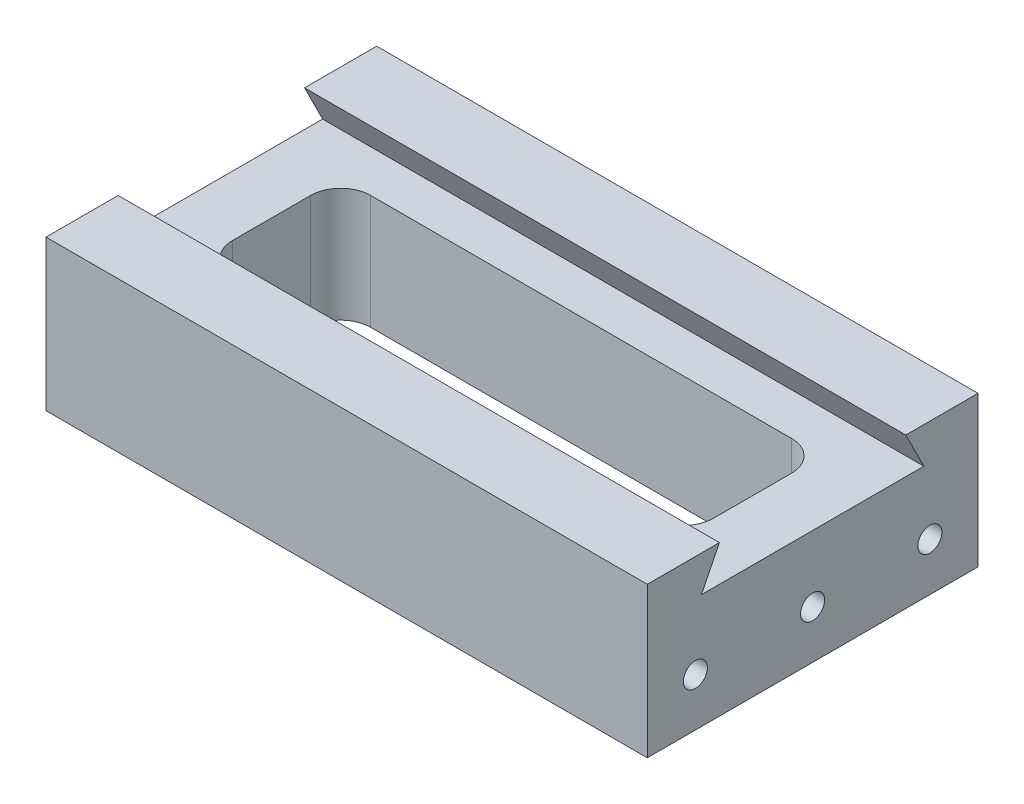
ISO-10303-21;
HEADER;
FILE_DESCRIPTION(('STEP AP214'),'2;1');
FILE_NAME('part.step','',(''),(''),'','','');
FILE_SCHEMA(('AUTOMOTIVE_DESIGN { 1 0 10303 214 1 1 1 1 }'));
ENDSEC;
DATA;
#1=APPLICATION_CONTEXT('core data for automotive mechanical design processes');
#2=APPLICATION_PROTOCOL_DEFINITION('international standard','automotive_design',2000,#1);
#3=PRODUCT_CONTEXT('',#1,'mechanical');
#4=PRODUCT('Part','Part','',(#3));
#5=PRODUCT_RELATED_PRODUCT_CATEGORY('part','',(#4));
#6=PRODUCT_DEFINITION_FORMATION('','',#4);
#7=PRODUCT_DEFINITION_CONTEXT('part definition',#1,'design');
#8=PRODUCT_DEFINITION('design','',#6,#7);
#9=PRODUCT_DEFINITION_SHAPE('','',#8);
#10=(LENGTH_UNIT() NAMED_UNIT(*) SI_UNIT(.MILLI.,.METRE.));
#11=(NAMED_UNIT(*) PLANE_ANGLE_UNIT() SI_UNIT($,.RADIAN.));
#12=(NAMED_UNIT(*) SI_UNIT($,.STERADIAN.) SOLID_ANGLE_UNIT());
#13=UNCERTAINTY_MEASURE_WITH_UNIT(LENGTH_MEASURE(1.E-05),#10,'distance_accuracy_value','');
#14=(GEOMETRIC_REPRESENTATION_CONTEXT(3) GLOBAL_UNCERTAINTY_ASSIGNED_CONTEXT((#13)) GLOBAL_UNIT_ASSIGNED_CONTEXT((#10,
#11,#12)) REPRESENTATION_CONTEXT('',''));
#15=CARTESIAN_POINT('',(0.,0.,0.));
#16=DIRECTION('',(0.,0.,1.));
#17=DIRECTION('',(1.,0.,0.));
#18=AXIS2_PLACEMENT_3D('',#15,#16,#17);
#19=CARTESIAN_POINT('',(50.,0.,0.));
#20=DIRECTION('',(0.,1.,0.));
#21=DIRECTION('',(0.,0.,1.));
#22=AXIS2_PLACEMENT_3D('',#19,#20,#21);
#23=PLANE('',#22);
#24=DIRECTION('',(0.,0.,-1.));
#25=VECTOR('',#24,1.);
#26=CARTESIAN_POINT('',(-50.,0.,0.));
#27=LINE('',#26,#25);
#28=CARTESIAN_POINT('',(-50.,0.,0.));
#29=VERTEX_POINT('',#28);
#30=CARTESIAN_POINT('',(-50.,0.,-55.));
#31=VERTEX_POINT('',#30);
#32=EDGE_CURVE('E289',#29,#31,#27,.T.);
#33=ORIENTED_EDGE('',*,*,#32,.T.);
#34=DIRECTION('',(-1.,0.,0.));
#35=VECTOR('',#34,1.);
#36=CARTESIAN_POINT('',(50.,0.,-55.));
#37=LINE('',#36,#35);
#38=CARTESIAN_POINT('',(50.,0.,-55.));
#39=VERTEX_POINT('',#38);
#40=EDGE_CURVE('E42',#39,#31,#37,.T.);
#41=ORIENTED_EDGE('',*,*,#40,.F.);
#42=DIRECTION('',(0.,0.,-1.));
#43=VECTOR('',#42,1.);
#44=CARTESIAN_POINT('',(50.,0.,0.));
#45=LINE('',#44,#43);
#46=CARTESIAN_POINT('',(50.,0.,0.));
#47=VERTEX_POINT('',#46);
#48=EDGE_CURVE('E271',#47,#39,#45,.T.);
#49=ORIENTED_EDGE('',*,*,#48,.F.);
#50=DIRECTION('',(-1.,0.,0.));
#51=VECTOR('',#50,1.);
#52=CARTESIAN_POINT('',(50.,0.,0.));
#53=LINE('',#52,#51);
#54=EDGE_CURVE('E11',#47,#29,#53,.T.);
#55=ORIENTED_EDGE('',*,*,#54,.T.);
#56=EDGE_LOOP('',(#33,#41,#49,#55));
#57=FACE_BOUND('',#56,.T.);
#58=DIRECTION('',(1.,0.,0.));
#59=VECTOR('',#58,1.);
#60=CARTESIAN_POINT('',(0.,0.,-39.));
#61=LINE('',#60,#59);
#62=CARTESIAN_POINT('',(-35.,0.,-39.));
#63=VERTEX_POINT('',#62);
#64=CARTESIAN_POINT('',(35.,0.,-39.));
#65=VERTEX_POINT('',#64);
#66=EDGE_CURVE('E167',#63,#65,#61,.T.);
#67=ORIENTED_EDGE('',*,*,#66,.F.);
#68=CARTESIAN_POINT('',(-35.,0.,-34.));
#69=DIRECTION('',(0.,1.,0.));
#70=DIRECTION('',(0.,0.,1.));
#71=AXIS2_PLACEMENT_3D('',#68,#69,#70);
#72=CIRCLE('',#71,5.);
#73=CARTESIAN_POINT('',(-40.,0.,-34.));
#74=VERTEX_POINT('',#73);
#75=EDGE_CURVE('E176',#63,#74,#72,.T.);
#76=ORIENTED_EDGE('',*,*,#75,.T.);
#77=DIRECTION('',(0.,0.,1.));
#78=VECTOR('',#77,1.);
#79=CARTESIAN_POINT('',(-40.,0.,0.));
#80=LINE('',#79,#78);
#81=CARTESIAN_POINT('',(-40.,0.,-21.));
#82=VERTEX_POINT('',#81);
#83=EDGE_CURVE('E49',#74,#82,#80,.T.);
#84=ORIENTED_EDGE('',*,*,#83,.T.);
#85=CARTESIAN_POINT('',(-35.,0.,-21.));
#86=DIRECTION('',(0.,1.,0.));
#87=DIRECTION('',(0.,0.,1.));
#88=AXIS2_PLACEMENT_3D('',#85,#86,#87);
#89=CIRCLE('',#88,5.);
#90=CARTESIAN_POINT('',(-35.,0.,-16.));
#91=VERTEX_POINT('',#90);
#92=EDGE_CURVE('E189',#82,#91,#89,.T.);
#93=ORIENTED_EDGE('',*,*,#92,.T.);
#94=DIRECTION('',(1.,0.,0.));
#95=VECTOR('',#94,1.);
#96=CARTESIAN_POINT('',(0.,0.,-16.));
#97=LINE('',#96,#95);
#98=CARTESIAN_POINT('',(35.,0.,-16.));
#99=VERTEX_POINT('',#98);
#100=EDGE_CURVE('E192',#91,#99,#97,.T.);
#101=ORIENTED_EDGE('',*,*,#100,.T.);
#102=CARTESIAN_POINT('',(35.,0.,-21.));
#103=DIRECTION('',(0.,1.,0.));
#104=DIRECTION('',(0.,0.,1.));
#105=AXIS2_PLACEMENT_3D('',#102,#103,#104);
#106=CIRCLE('',#105,5.);
#107=CARTESIAN_POINT('',(40.,0.,-21.));
#108=VERTEX_POINT('',#107);
#109=EDGE_CURVE('E195',#99,#108,#106,.T.);
#110=ORIENTED_EDGE('',*,*,#109,.T.);
#111=DIRECTION('',(0.,0.,1.));
#112=VECTOR('',#111,1.);
#113=CARTESIAN_POINT('',(40.,0.,0.));
#114=LINE('',#113,#112);
#115=CARTESIAN_POINT('',(40.,0.,-34.));
#116=VERTEX_POINT('',#115);
#117=EDGE_CURVE('E198',#116,#108,#114,.T.);
#118=ORIENTED_EDGE('',*,*,#117,.F.);
#119=CARTESIAN_POINT('',(35.,0.,-34.));
#120=DIRECTION('',(0.,1.,0.));
#121=DIRECTION('',(0.,0.,1.));
#122=AXIS2_PLACEMENT_3D('',#119,#120,#121);
#123=CIRCLE('',#122,5.);
#124=EDGE_CURVE('E173',#65,#116,#123,.F.);
#125=ORIENTED_EDGE('',*,*,#124,.F.);
#126=EDGE_LOOP('',(#67,#76,#84,#93,#101,#110,#118,#125));
#127=FACE_BOUND('',#126,.T.);
#128=ADVANCED_FACE('F34',(#57,#127),#23,.F.);
#129=CARTESIAN_POINT('',(50.,19.,-9.));
#130=DIRECTION('',(0.,-1.,0.));
#131=DIRECTION('',(0.,0.,-1.));
#132=AXIS2_PLACEMENT_3D('',#129,#130,#131);
#133=PLANE('',#132);
#134=DIRECTION('',(0.,0.,1.));
#135=VECTOR('',#134,1.);
#136=CARTESIAN_POINT('',(-50.,19.,-9.));
#137=LINE('',#136,#135);
#138=CARTESIAN_POINT('',(-50.,19.,-46.));
#139=VERTEX_POINT('',#138);
#140=CARTESIAN_POINT('',(-50.,19.,-9.));
#141=VERTEX_POINT('',#140);
#142=EDGE_CURVE('E297',#139,#141,#137,.T.);
#143=ORIENTED_EDGE('',*,*,#142,.T.);
#144=DIRECTION('',(-1.,0.,0.));
#145=VECTOR('',#144,1.);
#146=CARTESIAN_POINT('',(50.,19.,-9.));
#147=LINE('',#146,#145);
#148=CARTESIAN_POINT('',(50.,19.,-9.));
#149=VERTEX_POINT('',#148);
#150=EDGE_CURVE('E307',#149,#141,#147,.T.);
#151=ORIENTED_EDGE('',*,*,#150,.F.);
#152=DIRECTION('',(0.,0.,1.));
#153=VECTOR('',#152,1.);
#154=CARTESIAN_POINT('',(50.,19.,-9.));
#155=LINE('',#154,#153);
#156=CARTESIAN_POINT('',(50.,19.,-46.));
#157=VERTEX_POINT('',#156);
#158=EDGE_CURVE('E280',#157,#149,#155,.T.);
#159=ORIENTED_EDGE('',*,*,#158,.F.);
#160=DIRECTION('',(-1.,0.,0.));
#161=VECTOR('',#160,1.);
#162=CARTESIAN_POINT('',(50.,19.,-46.));
#163=LINE('',#162,#161);
#164=EDGE_CURVE('E310',#157,#139,#163,.T.);
#165=ORIENTED_EDGE('',*,*,#164,.T.);
#166=EDGE_LOOP('',(#143,#151,#159,#165));
#167=FACE_BOUND('',#166,.T.);
#168=DIRECTION('',(1.,0.,0.));
#169=VECTOR('',#168,1.);
#170=CARTESIAN_POINT('',(0.,19.,-39.));
#171=LINE('',#170,#169);
#172=CARTESIAN_POINT('',(-35.,19.,-39.));
#173=VERTEX_POINT('',#172);
#174=CARTESIAN_POINT('',(35.,19.,-39.));
#175=VERTEX_POINT('',#174);
#176=EDGE_CURVE('E57',#173,#175,#171,.T.);
#177=ORIENTED_EDGE('',*,*,#176,.T.);
#178=CARTESIAN_POINT('',(35.,19.,-34.));
#179=DIRECTION('',(0.,1.,0.));
#180=DIRECTION('',(0.,0.,1.));
#181=AXIS2_PLACEMENT_3D('',#178,#179,#180);
#182=CIRCLE('',#181,5.);
#183=CARTESIAN_POINT('',(40.,19.,-34.));
#184=VERTEX_POINT('',#183);
#185=EDGE_CURVE('E182',#175,#184,#182,.F.);
#186=ORIENTED_EDGE('',*,*,#185,.T.);
#187=DIRECTION('',(0.,0.,1.));
#188=VECTOR('',#187,1.);
#189=CARTESIAN_POINT('',(40.,19.,0.));
#190=LINE('',#189,#188);
#191=CARTESIAN_POINT('',(40.,19.,-21.));
#192=VERTEX_POINT('',#191);
#193=EDGE_CURVE('E185',#184,#192,#190,.T.);
#194=ORIENTED_EDGE('',*,*,#193,.T.);
#195=CARTESIAN_POINT('',(35.,19.,-21.));
#196=DIRECTION('',(0.,1.,0.));
#197=DIRECTION('',(0.,0.,1.));
#198=AXIS2_PLACEMENT_3D('',#195,#196,#197);
#199=CIRCLE('',#198,5.);
#200=CARTESIAN_POINT('',(35.,19.,-16.));
#201=VERTEX_POINT('',#200);
#202=EDGE_CURVE('E213',#201,#192,#199,.T.);
#203=ORIENTED_EDGE('',*,*,#202,.F.);
#204=DIRECTION('',(1.,0.,0.));
#205=VECTOR('',#204,1.);
#206=CARTESIAN_POINT('',(0.,19.,-16.));
#207=LINE('',#206,#205);
#208=CARTESIAN_POINT('',(-35.,19.,-16.));
#209=VERTEX_POINT('',#208);
#210=EDGE_CURVE('E210',#209,#201,#207,.T.);
#211=ORIENTED_EDGE('',*,*,#210,.F.);
#212=CARTESIAN_POINT('',(-35.,19.,-21.));
#213=DIRECTION('',(0.,1.,0.));
#214=DIRECTION('',(0.,0.,1.));
#215=AXIS2_PLACEMENT_3D('',#212,#213,#214);
#216=CIRCLE('',#215,5.);
#217=CARTESIAN_POINT('',(-40.,19.,-21.));
#218=VERTEX_POINT('',#217);
#219=EDGE_CURVE('E207',#218,#209,#216,.T.);
#220=ORIENTED_EDGE('',*,*,#219,.F.);
#221=DIRECTION('',(0.,0.,1.));
#222=VECTOR('',#221,1.);
#223=CARTESIAN_POINT('',(-40.,19.,0.));
#224=LINE('',#223,#222);
#225=CARTESIAN_POINT('',(-40.,19.,-34.));
#226=VERTEX_POINT('',#225);
#227=EDGE_CURVE('E204',#226,#218,#224,.T.);
#228=ORIENTED_EDGE('',*,*,#227,.F.);
#229=CARTESIAN_POINT('',(-35.,19.,-34.));
#230=DIRECTION('',(0.,1.,0.));
#231=DIRECTION('',(0.,0.,1.));
#232=AXIS2_PLACEMENT_3D('',#229,#230,#231);
#233=CIRCLE('',#232,5.);
#234=EDGE_CURVE('E202',#173,#226,#233,.T.);
#235=ORIENTED_EDGE('',*,*,#234,.F.);
#236=EDGE_LOOP('',(#177,#186,#194,#203,#211,#220,#228,#235));
#237=FACE_BOUND('',#236,.T.);
#238=ADVANCED_FACE('F358',(#167,#237),#133,.F.);
#239=CARTESIAN_POINT('',(50.,0.,0.));
#240=DIRECTION('',(0.,0.,-1.));
#241=DIRECTION('',(-1.,0.,0.));
#242=AXIS2_PLACEMENT_3D('',#239,#240,#241);
#243=PLANE('',#242);
#244=DIRECTION('',(0.,-1.,0.));
#245=VECTOR('',#244,1.);
#246=CARTESIAN_POINT('',(-50.,0.,0.));
#247=LINE('',#246,#245);
#248=CARTESIAN_POINT('',(-50.,25.,0.));
#249=VERTEX_POINT('',#248);
#250=EDGE_CURVE('E267',#249,#29,#247,.T.);
#251=ORIENTED_EDGE('',*,*,#250,.T.);
#252=ORIENTED_EDGE('',*,*,#54,.F.);
#253=DIRECTION('',(0.,-1.,0.));
#254=VECTOR('',#253,1.);
#255=CARTESIAN_POINT('',(50.,0.,0.));
#256=LINE('',#255,#254);
#257=CARTESIAN_POINT('',(50.,25.,0.));
#258=VERTEX_POINT('',#257);
#259=EDGE_CURVE('E268',#258,#47,#256,.T.);
#260=ORIENTED_EDGE('',*,*,#259,.F.);
#261=DIRECTION('',(-1.,0.,0.));
#262=VECTOR('',#261,1.);
#263=CARTESIAN_POINT('',(50.,25.,0.));
#264=LINE('',#263,#262);
#265=EDGE_CURVE('E286',#258,#249,#264,.T.);
#266=ORIENTED_EDGE('',*,*,#265,.T.);
#267=EDGE_LOOP('',(#251,#252,#260,#266));
#268=FACE_BOUND('',#267,.T.);
#269=ADVANCED_FACE('F36',(#268),#243,.F.);
#270=CARTESIAN_POINT('',(50.,0.,-55.));
#271=DIRECTION('',(0.,0.,1.));
#272=DIRECTION('',(1.,0.,0.));
#273=AXIS2_PLACEMENT_3D('',#270,#271,#272);
#274=PLANE('',#273);
#275=DIRECTION('',(0.,1.,0.));
#276=VECTOR('',#275,1.);
#277=CARTESIAN_POINT('',(-50.,0.,-55.));
#278=LINE('',#277,#276);
#279=CARTESIAN_POINT('',(-50.,25.,-55.));
#280=VERTEX_POINT('',#279);
#281=EDGE_CURVE('E291',#31,#280,#278,.T.);
#282=ORIENTED_EDGE('',*,*,#281,.T.);
#283=DIRECTION('',(-1.,0.,0.));
#284=VECTOR('',#283,1.);
#285=CARTESIAN_POINT('',(50.,25.,-55.));
#286=LINE('',#285,#284);
#287=CARTESIAN_POINT('',(50.,25.,-55.));
#288=VERTEX_POINT('',#287);
#289=EDGE_CURVE('E316',#288,#280,#286,.T.);
#290=ORIENTED_EDGE('',*,*,#289,.F.);
#291=DIRECTION('',(0.,1.,0.));
#292=VECTOR('',#291,1.);
#293=CARTESIAN_POINT('',(50.,0.,-55.));
#294=LINE('',#293,#292);
#295=EDGE_CURVE('E274',#39,#288,#294,.T.);
#296=ORIENTED_EDGE('',*,*,#295,.F.);
#297=ORIENTED_EDGE('',*,*,#40,.T.);
#298=EDGE_LOOP('',(#282,#290,#296,#297));
#299=FACE_BOUND('',#298,.T.);
#300=ADVANCED_FACE('F323',(#299),#274,.F.);
#301=CARTESIAN_POINT('',(50.,25.,-43.));
#302=DIRECTION('',(0.,-1.,0.));
#303=DIRECTION('',(0.,0.,-1.));
#304=AXIS2_PLACEMENT_3D('',#301,#302,#303);
#305=PLANE('',#304);
#306=DIRECTION('',(0.,0.,1.));
#307=VECTOR('',#306,1.);
#308=CARTESIAN_POINT('',(-50.,25.,-43.));
#309=LINE('',#308,#307);
#310=CARTESIAN_POINT('',(-50.,25.,-43.));
#311=VERTEX_POINT('',#310);
#312=EDGE_CURVE('E293',#280,#311,#309,.T.);
#313=ORIENTED_EDGE('',*,*,#312,.T.);
#314=DIRECTION('',(-1.,0.,0.));
#315=VECTOR('',#314,1.);
#316=CARTESIAN_POINT('',(50.,25.,-43.));
#317=LINE('',#316,#315);
#318=CARTESIAN_POINT('',(50.,25.,-43.));
#319=VERTEX_POINT('',#318);
#320=EDGE_CURVE('E313',#319,#311,#317,.T.);
#321=ORIENTED_EDGE('',*,*,#320,.F.);
#322=DIRECTION('',(0.,0.,1.));
#323=VECTOR('',#322,1.);
#324=CARTESIAN_POINT('',(50.,25.,-43.));
#325=LINE('',#324,#323);
#326=EDGE_CURVE('E276',#288,#319,#325,.T.);
#327=ORIENTED_EDGE('',*,*,#326,.F.);
#328=ORIENTED_EDGE('',*,*,#289,.T.);
#329=EDGE_LOOP('',(#313,#321,#327,#328));
#330=FACE_BOUND('',#329,.T.);
#331=ADVANCED_FACE('F334',(#330),#305,.F.);
#332=CARTESIAN_POINT('',(50.,19.,-46.));
#333=DIRECTION('',(0.,0.447213595499958,-0.894427190999916));
#334=DIRECTION('',(0.,0.894427190999916,0.447213595499958));
#335=AXIS2_PLACEMENT_3D('',#332,#333,#334);
#336=PLANE('',#335);
#337=DIRECTION('',(0.,-0.894427190999916,-0.447213595499958));
#338=VECTOR('',#337,1.);
#339=CARTESIAN_POINT('',(-50.,19.,-46.));
#340=LINE('',#339,#338);
#341=EDGE_CURVE('E295',#311,#139,#340,.T.);
#342=ORIENTED_EDGE('',*,*,#341,.T.);
#343=ORIENTED_EDGE('',*,*,#164,.F.);
#344=DIRECTION('',(0.,-0.894427190999916,-0.447213595499958));
#345=VECTOR('',#344,1.);
#346=CARTESIAN_POINT('',(50.,19.,-46.));
#347=LINE('',#346,#345);
#348=EDGE_CURVE('E278',#319,#157,#347,.T.);
#349=ORIENTED_EDGE('',*,*,#348,.F.);
#350=ORIENTED_EDGE('',*,*,#320,.T.);
#351=EDGE_LOOP('',(#342,#343,#349,#350));
#352=FACE_BOUND('',#351,.T.);
#353=ADVANCED_FACE('F338',(#352),#336,.F.);
#354=CARTESIAN_POINT('',(50.,19.,-9.));
#355=DIRECTION('',(0.,0.447213595499958,0.894427190999916));
#356=DIRECTION('',(0.,-0.894427190999916,0.447213595499958));
#357=AXIS2_PLACEMENT_3D('',#354,#355,#356);
#358=PLANE('',#357);
#359=DIRECTION('',(0.,0.894427190999916,-0.447213595499958));
#360=VECTOR('',#359,1.);
#361=CARTESIAN_POINT('',(-50.,19.,-9.));
#362=LINE('',#361,#360);
#363=CARTESIAN_POINT('',(-50.,25.,-12.));
#364=VERTEX_POINT('',#363);
#365=EDGE_CURVE('E299',#141,#364,#362,.T.);
#366=ORIENTED_EDGE('',*,*,#365,.T.);
#367=DIRECTION('',(-1.,0.,0.));
#368=VECTOR('',#367,1.);
#369=CARTESIAN_POINT('',(50.,25.,-12.));
#370=LINE('',#369,#368);
#371=CARTESIAN_POINT('',(50.,25.,-12.));
#372=VERTEX_POINT('',#371);
#373=EDGE_CURVE('E304',#372,#364,#370,.T.);
#374=ORIENTED_EDGE('',*,*,#373,.F.);
#375=DIRECTION('',(0.,0.894427190999916,-0.447213595499958));
#376=VECTOR('',#375,1.);
#377=CARTESIAN_POINT('',(50.,19.,-9.));
#378=LINE('',#377,#376);
#379=EDGE_CURVE('E282',#149,#372,#378,.T.);
#380=ORIENTED_EDGE('',*,*,#379,.F.);
#381=ORIENTED_EDGE('',*,*,#150,.T.);
#382=EDGE_LOOP('',(#366,#374,#380,#381));
#383=FACE_BOUND('',#382,.T.);
#384=ADVANCED_FACE('F356',(#383),#358,.F.);
#385=CARTESIAN_POINT('',(50.,25.,0.));
#386=DIRECTION('',(0.,-1.,0.));
#387=DIRECTION('',(0.,0.,-1.));
#388=AXIS2_PLACEMENT_3D('',#385,#386,#387);
#389=PLANE('',#388);
#390=DIRECTION('',(0.,0.,1.));
#391=VECTOR('',#390,1.);
#392=CARTESIAN_POINT('',(-50.,25.,0.));
#393=LINE('',#392,#391);
#394=EDGE_CURVE('E272',#364,#249,#393,.T.);
#395=ORIENTED_EDGE('',*,*,#394,.T.);
#396=ORIENTED_EDGE('',*,*,#265,.F.);
#397=DIRECTION('',(0.,0.,1.));
#398=VECTOR('',#397,1.);
#399=CARTESIAN_POINT('',(50.,25.,0.));
#400=LINE('',#399,#398);
#401=EDGE_CURVE('E284',#372,#258,#400,.T.);
#402=ORIENTED_EDGE('',*,*,#401,.F.);
#403=ORIENTED_EDGE('',*,*,#373,.T.);
#404=EDGE_LOOP('',(#395,#396,#402,#403));
#405=FACE_BOUND('',#404,.T.);
#406=ADVANCED_FACE('F351',(#405),#389,.F.);
#407=CARTESIAN_POINT('',(50.,0.,0.));
#408=DIRECTION('',(-1.,0.,0.));
#409=DIRECTION('',(0.,0.,1.));
#410=AXIS2_PLACEMENT_3D('',#407,#408,#409);
#411=PLANE('',#410);
#412=CARTESIAN_POINT('',(50.,8.,-8.));
#413=DIRECTION('',(1.,0.,0.));
#414=DIRECTION('',(0.,0.,-1.));
#415=AXIS2_PLACEMENT_3D('',#412,#413,#414);
#416=CIRCLE('',#415,1.99999999999999);
#417=CARTESIAN_POINT('',(50.,8.,-9.99999999999999));
#418=VERTEX_POINT('',#417);
#419=EDGE_CURVE('E249',#418,#418,#416,.T.);
#420=ORIENTED_EDGE('',*,*,#419,.F.);
#421=EDGE_LOOP('',(#420));
#422=FACE_BOUND('',#421,.T.);
#423=CARTESIAN_POINT('',(50.,8.,-27.5));
#424=DIRECTION('',(1.,0.,0.));
#425=DIRECTION('',(0.,0.,-1.));
#426=AXIS2_PLACEMENT_3D('',#423,#424,#425);
#427=CIRCLE('',#426,1.99999999999999);
#428=CARTESIAN_POINT('',(50.,8.,-29.5));
#429=VERTEX_POINT('',#428);
#430=EDGE_CURVE('E255',#429,#429,#427,.T.);
#431=ORIENTED_EDGE('',*,*,#430,.F.);
#432=EDGE_LOOP('',(#431));
#433=FACE_BOUND('',#432,.T.);
#434=CARTESIAN_POINT('',(50.,8.,-47.));
#435=DIRECTION('',(1.,0.,0.));
#436=DIRECTION('',(0.,0.,-1.));
#437=AXIS2_PLACEMENT_3D('',#434,#435,#436);
#438=CIRCLE('',#437,1.99999999999999);
#439=CARTESIAN_POINT('',(50.,8.,-49.));
#440=VERTEX_POINT('',#439);
#441=EDGE_CURVE('E261',#440,#440,#438,.T.);
#442=ORIENTED_EDGE('',*,*,#441,.F.);
#443=EDGE_LOOP('',(#442));
#444=FACE_BOUND('',#443,.T.);
#445=ORIENTED_EDGE('',*,*,#259,.T.);
#446=ORIENTED_EDGE('',*,*,#48,.T.);
#447=ORIENTED_EDGE('',*,*,#295,.T.);
#448=ORIENTED_EDGE('',*,*,#326,.T.);
#449=ORIENTED_EDGE('',*,*,#348,.T.);
#450=ORIENTED_EDGE('',*,*,#158,.T.);
#451=ORIENTED_EDGE('',*,*,#379,.T.);
#452=ORIENTED_EDGE('',*,*,#401,.T.);
#453=EDGE_LOOP('',(#445,#446,#447,#448,#449,#450,#451,#452));
#454=FACE_BOUND('',#453,.T.);
#455=ADVANCED_FACE('F342',(#422,#433,#444,#454),#411,.F.);
#456=CARTESIAN_POINT('',(-50.,0.,0.));
#457=DIRECTION('',(-1.,0.,0.));
#458=DIRECTION('',(0.,0.,1.));
#459=AXIS2_PLACEMENT_3D('',#456,#457,#458);
#460=PLANE('',#459);
#461=CARTESIAN_POINT('',(-50.,8.,-8.));
#462=DIRECTION('',(-1.,0.,0.));
#463=DIRECTION('',(0.,0.,1.));
#464=AXIS2_PLACEMENT_3D('',#461,#462,#463);
#465=CIRCLE('',#464,1.99999999999999);
#466=CARTESIAN_POINT('',(-50.,8.,-6.00000000000001));
#467=VERTEX_POINT('',#466);
#468=EDGE_CURVE('E220',#467,#467,#465,.T.);
#469=ORIENTED_EDGE('',*,*,#468,.F.);
#470=EDGE_LOOP('',(#469));
#471=FACE_BOUND('',#470,.T.);
#472=CARTESIAN_POINT('',(-50.,8.,-27.5));
#473=DIRECTION('',(-1.,0.,0.));
#474=DIRECTION('',(0.,0.,1.));
#475=AXIS2_PLACEMENT_3D('',#472,#473,#474);
#476=CIRCLE('',#475,1.99999999999999);
#477=CARTESIAN_POINT('',(-50.,8.,-25.5));
#478=VERTEX_POINT('',#477);
#479=EDGE_CURVE('E237',#478,#478,#476,.T.);
#480=ORIENTED_EDGE('',*,*,#479,.F.);
#481=EDGE_LOOP('',(#480));
#482=FACE_BOUND('',#481,.T.);
#483=CARTESIAN_POINT('',(-50.,8.,-47.));
#484=DIRECTION('',(-1.,0.,0.));
#485=DIRECTION('',(0.,0.,1.));
#486=AXIS2_PLACEMENT_3D('',#483,#484,#485);
#487=CIRCLE('',#486,1.99999999999999);
#488=CARTESIAN_POINT('',(-50.,8.,-45.));
#489=VERTEX_POINT('',#488);
#490=EDGE_CURVE('E243',#489,#489,#487,.T.);
#491=ORIENTED_EDGE('',*,*,#490,.F.);
#492=EDGE_LOOP('',(#491));
#493=FACE_BOUND('',#492,.T.);
#494=ORIENTED_EDGE('',*,*,#250,.F.);
#495=ORIENTED_EDGE('',*,*,#394,.F.);
#496=ORIENTED_EDGE('',*,*,#365,.F.);
#497=ORIENTED_EDGE('',*,*,#142,.F.);
#498=ORIENTED_EDGE('',*,*,#341,.F.);
#499=ORIENTED_EDGE('',*,*,#312,.F.);
#500=ORIENTED_EDGE('',*,*,#281,.F.);
#501=ORIENTED_EDGE('',*,*,#32,.F.);
#502=EDGE_LOOP('',(#494,#495,#496,#497,#498,#499,#500,#501));
#503=FACE_BOUND('',#502,.T.);
#504=ADVANCED_FACE('F329',(#471,#482,#493,#503),#460,.T.);
#505=CARTESIAN_POINT('',(42.8,8.,-47.));
#506=DIRECTION('',(1.,0.,0.));
#507=DIRECTION('',(0.,0.,-1.));
#508=AXIS2_PLACEMENT_3D('',#505,#506,#507);
#509=CONICAL_SURFACE('',#508,2.,1.02974425867665);
#510=CARTESIAN_POINT('',(41.5982787619449,8.,-47.));
#511=VERTEX_POINT('',#510);
#512=VERTEX_LOOP('',#511);
#513=FACE_BOUND('',#512,.T.);
#514=CARTESIAN_POINT('',(42.8,8.,-47.));
#515=DIRECTION('',(1.,0.,0.));
#516=DIRECTION('',(0.,0.,-1.));
#517=AXIS2_PLACEMENT_3D('',#514,#515,#516);
#518=CIRCLE('',#517,2.);
#519=CARTESIAN_POINT('',(42.8,8.,-49.));
#520=VERTEX_POINT('',#519);
#521=EDGE_CURVE('E264',#520,#520,#518,.T.);
#522=ORIENTED_EDGE('',*,*,#521,.T.);
#523=EDGE_LOOP('',(#522));
#524=FACE_BOUND('',#523,.T.);
#525=ADVANCED_FACE('F408',(#513,#524),#509,.F.);
#526=CARTESIAN_POINT('',(50.,8.,-47.));
#527=DIRECTION('',(1.,0.,0.));
#528=DIRECTION('',(0.,0.,-1.));
#529=AXIS2_PLACEMENT_3D('',#526,#527,#528);
#530=CYLINDRICAL_SURFACE('',#529,1.99999999999999);
#531=ORIENTED_EDGE('',*,*,#521,.F.);
#532=EDGE_LOOP('',(#531));
#533=FACE_BOUND('',#532,.T.);
#534=ORIENTED_EDGE('',*,*,#441,.T.);
#535=EDGE_LOOP('',(#534));
#536=FACE_BOUND('',#535,.T.);
#537=ADVANCED_FACE('F415',(#533,#536),#530,.F.);
#538=CARTESIAN_POINT('',(42.8,8.,-27.5));
#539=DIRECTION('',(1.,0.,0.));
#540=DIRECTION('',(0.,0.,-1.));
#541=AXIS2_PLACEMENT_3D('',#538,#539,#540);
#542=CONICAL_SURFACE('',#541,2.,1.02974425867665);
#543=CARTESIAN_POINT('',(41.5982787619449,8.,-27.5));
#544=VERTEX_POINT('',#543);
#545=VERTEX_LOOP('',#544);
#546=FACE_BOUND('',#545,.T.);
#547=CARTESIAN_POINT('',(42.8,8.,-27.5));
#548=DIRECTION('',(1.,0.,0.));
#549=DIRECTION('',(0.,0.,-1.));
#550=AXIS2_PLACEMENT_3D('',#547,#548,#549);
#551=CIRCLE('',#550,2.);
#552=CARTESIAN_POINT('',(42.8,8.,-29.5));
#553=VERTEX_POINT('',#552);
#554=EDGE_CURVE('E258',#553,#553,#551,.T.);
#555=ORIENTED_EDGE('',*,*,#554,.T.);
#556=EDGE_LOOP('',(#555));
#557=FACE_BOUND('',#556,.T.);
#558=ADVANCED_FACE('F419',(#546,#557),#542,.F.);
#559=CARTESIAN_POINT('',(50.,8.,-27.5));
#560=DIRECTION('',(1.,0.,0.));
#561=DIRECTION('',(0.,0.,-1.));
#562=AXIS2_PLACEMENT_3D('',#559,#560,#561);
#563=CYLINDRICAL_SURFACE('',#562,1.99999999999999);
#564=ORIENTED_EDGE('',*,*,#554,.F.);
#565=EDGE_LOOP('',(#564));
#566=FACE_BOUND('',#565,.T.);
#567=ORIENTED_EDGE('',*,*,#430,.T.);
#568=EDGE_LOOP('',(#567));
#569=FACE_BOUND('',#568,.T.);
#570=ADVANCED_FACE('F423',(#566,#569),#563,.F.);
#571=CARTESIAN_POINT('',(42.8,8.,-8.));
#572=DIRECTION('',(1.,0.,0.));
#573=DIRECTION('',(0.,0.,-1.));
#574=AXIS2_PLACEMENT_3D('',#571,#572,#573);
#575=CONICAL_SURFACE('',#574,2.,1.02974425867665);
#576=CARTESIAN_POINT('',(41.5982787619449,8.,-8.));
#577=VERTEX_POINT('',#576);
#578=VERTEX_LOOP('',#577);
#579=FACE_BOUND('',#578,.T.);
#580=CARTESIAN_POINT('',(42.8,8.,-8.));
#581=DIRECTION('',(1.,0.,0.));
#582=DIRECTION('',(0.,0.,-1.));
#583=AXIS2_PLACEMENT_3D('',#580,#581,#582);
#584=CIRCLE('',#583,2.);
#585=CARTESIAN_POINT('',(42.8,8.,-10.));
#586=VERTEX_POINT('',#585);
#587=EDGE_CURVE('E252',#586,#586,#584,.T.);
#588=ORIENTED_EDGE('',*,*,#587,.T.);
#589=EDGE_LOOP('',(#588));
#590=FACE_BOUND('',#589,.T.);
#591=ADVANCED_FACE('F427',(#579,#590),#575,.F.);
#592=CARTESIAN_POINT('',(50.,8.,-8.));
#593=DIRECTION('',(1.,0.,0.));
#594=DIRECTION('',(0.,0.,-1.));
#595=AXIS2_PLACEMENT_3D('',#592,#593,#594);
#596=CYLINDRICAL_SURFACE('',#595,1.99999999999999);
#597=ORIENTED_EDGE('',*,*,#587,.F.);
#598=EDGE_LOOP('',(#597));
#599=FACE_BOUND('',#598,.T.);
#600=ORIENTED_EDGE('',*,*,#419,.T.);
#601=EDGE_LOOP('',(#600));
#602=FACE_BOUND('',#601,.T.);
#603=ADVANCED_FACE('F431',(#599,#602),#596,.F.);
#604=CARTESIAN_POINT('',(-42.8,8.,-47.));
#605=DIRECTION('',(-1.,0.,0.));
#606=DIRECTION('',(0.,0.,1.));
#607=AXIS2_PLACEMENT_3D('',#604,#605,#606);
#608=CONICAL_SURFACE('',#607,2.,1.02974425867665);
#609=CARTESIAN_POINT('',(-41.5982787619449,8.,-47.));
#610=VERTEX_POINT('',#609);
#611=VERTEX_LOOP('',#610);
#612=FACE_BOUND('',#611,.T.);
#613=CARTESIAN_POINT('',(-42.8,8.,-47.));
#614=DIRECTION('',(-1.,0.,0.));
#615=DIRECTION('',(0.,0.,1.));
#616=AXIS2_PLACEMENT_3D('',#613,#614,#615);
#617=CIRCLE('',#616,2.);
#618=CARTESIAN_POINT('',(-42.8,8.,-45.));
#619=VERTEX_POINT('',#618);
#620=EDGE_CURVE('E246',#619,#619,#617,.T.);
#621=ORIENTED_EDGE('',*,*,#620,.T.);
#622=EDGE_LOOP('',(#621));
#623=FACE_BOUND('',#622,.T.);
#624=ADVANCED_FACE('F435',(#612,#623),#608,.F.);
#625=CARTESIAN_POINT('',(-50.,8.,-47.));
#626=DIRECTION('',(-1.,0.,0.));
#627=DIRECTION('',(0.,0.,1.));
#628=AXIS2_PLACEMENT_3D('',#625,#626,#627);
#629=CYLINDRICAL_SURFACE('',#628,1.99999999999999);
#630=ORIENTED_EDGE('',*,*,#620,.F.);
#631=EDGE_LOOP('',(#630));
#632=FACE_BOUND('',#631,.T.);
#633=ORIENTED_EDGE('',*,*,#490,.T.);
#634=EDGE_LOOP('',(#633));
#635=FACE_BOUND('',#634,.T.);
#636=ADVANCED_FACE('F439',(#632,#635),#629,.F.);
#637=CARTESIAN_POINT('',(-42.8,8.,-27.5));
#638=DIRECTION('',(-1.,0.,0.));
#639=DIRECTION('',(0.,0.,1.));
#640=AXIS2_PLACEMENT_3D('',#637,#638,#639);
#641=CONICAL_SURFACE('',#640,2.,1.02974425867665);
#642=CARTESIAN_POINT('',(-41.5982787619449,8.,-27.5));
#643=VERTEX_POINT('',#642);
#644=VERTEX_LOOP('',#643);
#645=FACE_BOUND('',#644,.T.);
#646=CARTESIAN_POINT('',(-42.8,8.,-27.5));
#647=DIRECTION('',(-1.,0.,0.));
#648=DIRECTION('',(0.,0.,1.));
#649=AXIS2_PLACEMENT_3D('',#646,#647,#648);
#650=CIRCLE('',#649,2.);
#651=CARTESIAN_POINT('',(-42.8,8.,-25.5));
#652=VERTEX_POINT('',#651);
#653=EDGE_CURVE('E240',#652,#652,#650,.T.);
#654=ORIENTED_EDGE('',*,*,#653,.T.);
#655=EDGE_LOOP('',(#654));
#656=FACE_BOUND('',#655,.T.);
#657=ADVANCED_FACE('F443',(#645,#656),#641,.F.);
#658=CARTESIAN_POINT('',(-50.,8.,-27.5));
#659=DIRECTION('',(-1.,0.,0.));
#660=DIRECTION('',(0.,0.,1.));
#661=AXIS2_PLACEMENT_3D('',#658,#659,#660);
#662=CYLINDRICAL_SURFACE('',#661,1.99999999999999);
#663=ORIENTED_EDGE('',*,*,#653,.F.);
#664=EDGE_LOOP('',(#663));
#665=FACE_BOUND('',#664,.T.);
#666=ORIENTED_EDGE('',*,*,#479,.T.);
#667=EDGE_LOOP('',(#666));
#668=FACE_BOUND('',#667,.T.);
#669=ADVANCED_FACE('F447',(#665,#668),#662,.F.);
#670=CARTESIAN_POINT('',(-42.8,8.,-8.));
#671=DIRECTION('',(-1.,0.,0.));
#672=DIRECTION('',(0.,0.,1.));
#673=AXIS2_PLACEMENT_3D('',#670,#671,#672);
#674=CONICAL_SURFACE('',#673,2.,1.02974425867665);
#675=CARTESIAN_POINT('',(-41.5982787619449,8.,-8.));
#676=VERTEX_POINT('',#675);
#677=VERTEX_LOOP('',#676);
#678=FACE_BOUND('',#677,.T.);
#679=CARTESIAN_POINT('',(-42.8,8.,-8.));
#680=DIRECTION('',(-1.,0.,0.));
#681=DIRECTION('',(0.,0.,1.));
#682=AXIS2_PLACEMENT_3D('',#679,#680,#681);
#683=CIRCLE('',#682,2.);
#684=CARTESIAN_POINT('',(-42.8,8.,-6.));
#685=VERTEX_POINT('',#684);
#686=EDGE_CURVE('E234',#685,#685,#683,.T.);
#687=ORIENTED_EDGE('',*,*,#686,.T.);
#688=EDGE_LOOP('',(#687));
#689=FACE_BOUND('',#688,.T.);
#690=ADVANCED_FACE('F451',(#678,#689),#674,.F.);
#691=CARTESIAN_POINT('',(-50.,8.,-8.));
#692=DIRECTION('',(-1.,0.,0.));
#693=DIRECTION('',(0.,0.,1.));
#694=AXIS2_PLACEMENT_3D('',#691,#692,#693);
#695=CYLINDRICAL_SURFACE('',#694,1.99999999999999);
#696=ORIENTED_EDGE('',*,*,#686,.F.);
#697=EDGE_LOOP('',(#696));
#698=FACE_BOUND('',#697,.T.);
#699=ORIENTED_EDGE('',*,*,#468,.T.);
#700=EDGE_LOOP('',(#699));
#701=FACE_BOUND('',#700,.T.);
#702=ADVANCED_FACE('F390',(#698,#701),#695,.F.);
#703=CARTESIAN_POINT('',(0.,0.,-39.));
#704=DIRECTION('',(0.,0.,1.));
#705=DIRECTION('',(1.,0.,0.));
#706=AXIS2_PLACEMENT_3D('',#703,#704,#705);
#707=PLANE('',#706);
#708=ORIENTED_EDGE('',*,*,#176,.F.);
#709=DIRECTION('',(0.,1.,0.));
#710=VECTOR('',#709,1.);
#711=CARTESIAN_POINT('',(-35.,0.,-39.));
#712=LINE('',#711,#710);
#713=EDGE_CURVE('E163',#63,#173,#712,.T.);
#714=ORIENTED_EDGE('',*,*,#713,.F.);
#715=ORIENTED_EDGE('',*,*,#66,.T.);
#716=DIRECTION('',(0.,1.,0.));
#717=VECTOR('',#716,1.);
#718=CARTESIAN_POINT('',(35.,0.,-39.));
#719=LINE('',#718,#717);
#720=EDGE_CURVE('E218',#65,#175,#719,.T.);
#721=ORIENTED_EDGE('',*,*,#720,.T.);
#722=EDGE_LOOP('',(#708,#714,#715,#721));
#723=FACE_BOUND('',#722,.T.);
#724=ADVANCED_FACE('F165',(#723),#707,.T.);
#725=CARTESIAN_POINT('',(35.,0.,-34.));
#726=DIRECTION('',(0.,1.,0.));
#727=DIRECTION('',(0.,0.,1.));
#728=AXIS2_PLACEMENT_3D('',#725,#726,#727);
#729=CYLINDRICAL_SURFACE('',#728,5.);
#730=ORIENTED_EDGE('',*,*,#185,.F.);
#731=ORIENTED_EDGE('',*,*,#720,.F.);
#732=ORIENTED_EDGE('',*,*,#124,.T.);
#733=DIRECTION('',(0.,1.,0.));
#734=VECTOR('',#733,1.);
#735=CARTESIAN_POINT('',(40.,0.,-34.));
#736=LINE('',#735,#734);
#737=EDGE_CURVE('E221',#116,#184,#736,.T.);
#738=ORIENTED_EDGE('',*,*,#737,.T.);
#739=EDGE_LOOP('',(#730,#731,#732,#738));
#740=FACE_BOUND('',#739,.T.);
#741=ADVANCED_FACE('F382',(#740),#729,.F.);
#742=CARTESIAN_POINT('',(40.,0.,0.));
#743=DIRECTION('',(-1.,0.,0.));
#744=DIRECTION('',(0.,0.,1.));
#745=AXIS2_PLACEMENT_3D('',#742,#743,#744);
#746=PLANE('',#745);
#747=ORIENTED_EDGE('',*,*,#193,.F.);
#748=ORIENTED_EDGE('',*,*,#737,.F.);
#749=ORIENTED_EDGE('',*,*,#117,.T.);
#750=DIRECTION('',(0.,1.,0.));
#751=VECTOR('',#750,1.);
#752=CARTESIAN_POINT('',(40.,0.,-21.));
#753=LINE('',#752,#751);
#754=EDGE_CURVE('E223',#108,#192,#753,.T.);
#755=ORIENTED_EDGE('',*,*,#754,.T.);
#756=EDGE_LOOP('',(#747,#748,#749,#755));
#757=FACE_BOUND('',#756,.T.);
#758=ADVANCED_FACE('F379',(#757),#746,.T.);
#759=CARTESIAN_POINT('',(35.,0.,-21.));
#760=DIRECTION('',(0.,1.,0.));
#761=DIRECTION('',(0.,0.,1.));
#762=AXIS2_PLACEMENT_3D('',#759,#760,#761);
#763=CYLINDRICAL_SURFACE('',#762,5.);
#764=ORIENTED_EDGE('',*,*,#202,.T.);
#765=ORIENTED_EDGE('',*,*,#754,.F.);
#766=ORIENTED_EDGE('',*,*,#109,.F.);
#767=DIRECTION('',(0.,1.,0.));
#768=VECTOR('',#767,1.);
#769=CARTESIAN_POINT('',(35.,0.,-16.));
#770=LINE('',#769,#768);
#771=EDGE_CURVE('E225',#99,#201,#770,.T.);
#772=ORIENTED_EDGE('',*,*,#771,.T.);
#773=EDGE_LOOP('',(#764,#765,#766,#772));
#774=FACE_BOUND('',#773,.T.);
#775=ADVANCED_FACE('F376',(#774),#763,.F.);
#776=CARTESIAN_POINT('',(0.,0.,-16.));
#777=DIRECTION('',(0.,0.,1.));
#778=DIRECTION('',(1.,0.,0.));
#779=AXIS2_PLACEMENT_3D('',#776,#777,#778);
#780=PLANE('',#779);
#781=ORIENTED_EDGE('',*,*,#210,.T.);
#782=ORIENTED_EDGE('',*,*,#771,.F.);
#783=ORIENTED_EDGE('',*,*,#100,.F.);
#784=DIRECTION('',(0.,1.,0.));
#785=VECTOR('',#784,1.);
#786=CARTESIAN_POINT('',(-35.,0.,-16.));
#787=LINE('',#786,#785);
#788=EDGE_CURVE('E227',#91,#209,#787,.T.);
#789=ORIENTED_EDGE('',*,*,#788,.T.);
#790=EDGE_LOOP('',(#781,#782,#783,#789));
#791=FACE_BOUND('',#790,.T.);
#792=ADVANCED_FACE('F372',(#791),#780,.F.);
#793=CARTESIAN_POINT('',(-35.,0.,-21.));
#794=DIRECTION('',(0.,1.,0.));
#795=DIRECTION('',(0.,0.,1.));
#796=AXIS2_PLACEMENT_3D('',#793,#794,#795);
#797=CYLINDRICAL_SURFACE('',#796,5.);
#798=ORIENTED_EDGE('',*,*,#219,.T.);
#799=ORIENTED_EDGE('',*,*,#788,.F.);
#800=ORIENTED_EDGE('',*,*,#92,.F.);
#801=DIRECTION('',(0.,1.,0.));
#802=VECTOR('',#801,1.);
#803=CARTESIAN_POINT('',(-40.,0.,-21.));
#804=LINE('',#803,#802);
#805=EDGE_CURVE('E229',#82,#218,#804,.T.);
#806=ORIENTED_EDGE('',*,*,#805,.T.);
#807=EDGE_LOOP('',(#798,#799,#800,#806));
#808=FACE_BOUND('',#807,.T.);
#809=ADVANCED_FACE('F368',(#808),#797,.F.);
#810=CARTESIAN_POINT('',(-40.,0.,0.));
#811=DIRECTION('',(-1.,0.,0.));
#812=DIRECTION('',(0.,0.,1.));
#813=AXIS2_PLACEMENT_3D('',#810,#811,#812);
#814=PLANE('',#813);
#815=ORIENTED_EDGE('',*,*,#227,.T.);
#816=ORIENTED_EDGE('',*,*,#805,.F.);
#817=ORIENTED_EDGE('',*,*,#83,.F.);
#818=DIRECTION('',(0.,1.,0.));
#819=VECTOR('',#818,1.);
#820=CARTESIAN_POINT('',(-40.,0.,-34.));
#821=LINE('',#820,#819);
#822=EDGE_CURVE('E172',#74,#226,#821,.T.);
#823=ORIENTED_EDGE('',*,*,#822,.T.);
#824=EDGE_LOOP('',(#815,#816,#817,#823));
#825=FACE_BOUND('',#824,.T.);
#826=ADVANCED_FACE('F365',(#825),#814,.F.);
#827=CARTESIAN_POINT('',(-35.,0.,-34.));
#828=DIRECTION('',(0.,1.,0.));
#829=DIRECTION('',(0.,0.,1.));
#830=AXIS2_PLACEMENT_3D('',#827,#828,#829);
#831=CYLINDRICAL_SURFACE('',#830,5.);
#832=ORIENTED_EDGE('',*,*,#234,.T.);
#833=ORIENTED_EDGE('',*,*,#822,.F.);
#834=ORIENTED_EDGE('',*,*,#75,.F.);
#835=ORIENTED_EDGE('',*,*,#713,.T.);
#836=EDGE_LOOP('',(#832,#833,#834,#835));
#837=FACE_BOUND('',#836,.T.);
#838=ADVANCED_FACE('F177',(#837),#831,.F.);
#839=CLOSED_SHELL('',(#128,#238,#269,#300,#331,#353,#384,#406,#455,#504,#525,#537,#558,#570,
#591,#603,#624,#636,#657,#669,#690,#702,#724,#741,#758,#775,#792,#809,#826,#838));
#840=MANIFOLD_SOLID_BREP('B2',#839);
#841=ADVANCED_BREP_SHAPE_REPRESENTATION('',(#18,#840),#14);
#842=SHAPE_DEFINITION_REPRESENTATION(#9,#841);
ENDSEC;
END-ISO-10303-21;
